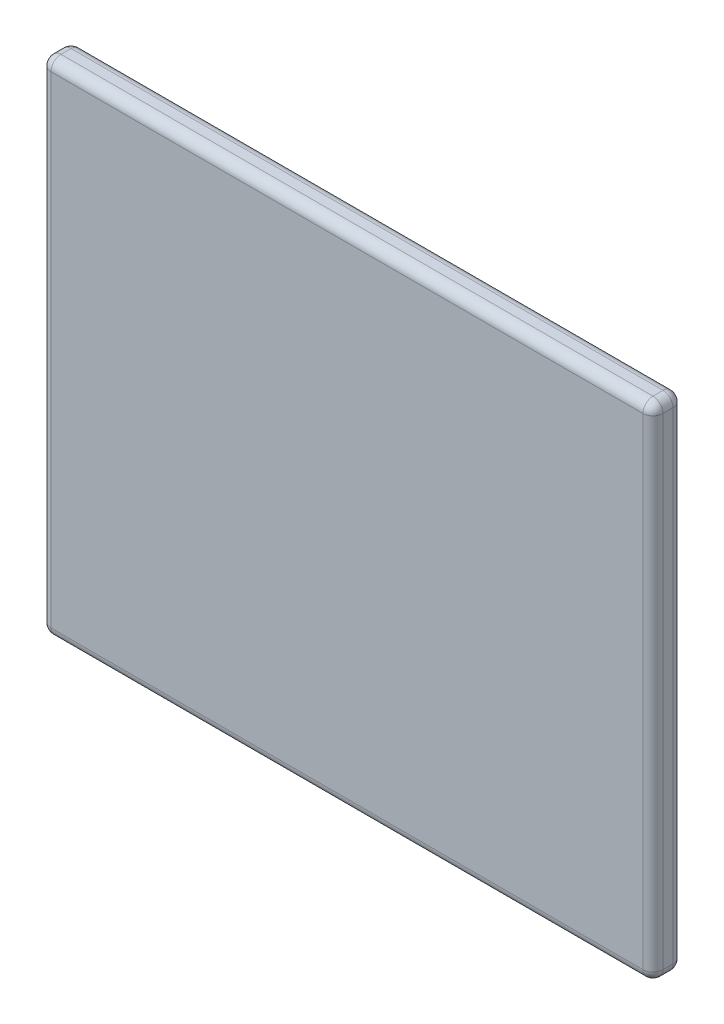
ISO-10303-21;
HEADER;
FILE_DESCRIPTION(('STEP AP214'),'2;1');
FILE_NAME('part.step','',(''),(''),'','','');
FILE_SCHEMA(('AUTOMOTIVE_DESIGN { 1 0 10303 214 1 1 1 1 }'));
ENDSEC;
DATA;
#1=APPLICATION_CONTEXT('core data for automotive mechanical design processes');
#2=APPLICATION_PROTOCOL_DEFINITION('international standard','automotive_design',2000,#1);
#3=PRODUCT_CONTEXT('',#1,'mechanical');
#4=PRODUCT('Part','Part','',(#3));
#5=PRODUCT_RELATED_PRODUCT_CATEGORY('part','',(#4));
#6=PRODUCT_DEFINITION_FORMATION('','',#4);
#7=PRODUCT_DEFINITION_CONTEXT('part definition',#1,'design');
#8=PRODUCT_DEFINITION('design','',#6,#7);
#9=PRODUCT_DEFINITION_SHAPE('','',#8);
#10=(LENGTH_UNIT() NAMED_UNIT(*) SI_UNIT(.MILLI.,.METRE.));
#11=(NAMED_UNIT(*) PLANE_ANGLE_UNIT() SI_UNIT($,.RADIAN.));
#12=(NAMED_UNIT(*) SI_UNIT($,.STERADIAN.) SOLID_ANGLE_UNIT());
#13=UNCERTAINTY_MEASURE_WITH_UNIT(LENGTH_MEASURE(1.E-05),#10,'distance_accuracy_value','');
#14=(GEOMETRIC_REPRESENTATION_CONTEXT(3) GLOBAL_UNCERTAINTY_ASSIGNED_CONTEXT((#13)) GLOBAL_UNIT_ASSIGNED_CONTEXT((#10,
#11,#12)) REPRESENTATION_CONTEXT('',''));
#15=CARTESIAN_POINT('',(0.,0.,0.));
#16=DIRECTION('',(0.,0.,1.));
#17=DIRECTION('',(1.,0.,0.));
#18=AXIS2_PLACEMENT_3D('',#15,#16,#17);
#19=CARTESIAN_POINT('',(30.5,25.,3.));
#20=DIRECTION('',(-1.,0.,0.));
#21=DIRECTION('',(0.,-1.,0.));
#22=AXIS2_PLACEMENT_3D('',#19,#20,#21);
#23=PLANE('',#22);
#24=DIRECTION('',(0.,0.,-1.));
#25=VECTOR('',#24,1.);
#26=CARTESIAN_POINT('',(30.5,24.,3.));
#27=LINE('',#26,#25);
#28=CARTESIAN_POINT('',(30.5,24.,1.));
#29=VERTEX_POINT('',#28);
#30=CARTESIAN_POINT('',(30.5,24.,2.));
#31=VERTEX_POINT('',#30);
#32=EDGE_CURVE('E202',#29,#31,#27,.F.);
#33=ORIENTED_EDGE('',*,*,#32,.T.);
#34=DIRECTION('',(0.,1.,0.));
#35=VECTOR('',#34,1.);
#36=CARTESIAN_POINT('',(30.5,-25.,2.));
#37=LINE('',#36,#35);
#38=CARTESIAN_POINT('',(30.5,-24.,2.));
#39=VERTEX_POINT('',#38);
#40=EDGE_CURVE('E205',#31,#39,#37,.F.);
#41=ORIENTED_EDGE('',*,*,#40,.T.);
#42=DIRECTION('',(0.,0.,-1.));
#43=VECTOR('',#42,1.);
#44=CARTESIAN_POINT('',(30.5,-24.,3.));
#45=LINE('',#44,#43);
#46=CARTESIAN_POINT('',(30.5,-24.,1.));
#47=VERTEX_POINT('',#46);
#48=EDGE_CURVE('E196',#39,#47,#45,.T.);
#49=ORIENTED_EDGE('',*,*,#48,.T.);
#50=DIRECTION('',(0.,1.,0.));
#51=VECTOR('',#50,1.);
#52=CARTESIAN_POINT('',(30.5,25.,1.));
#53=LINE('',#52,#51);
#54=EDGE_CURVE('E199',#47,#29,#53,.T.);
#55=ORIENTED_EDGE('',*,*,#54,.T.);
#56=EDGE_LOOP('',(#33,#41,#49,#55));
#57=FACE_BOUND('',#56,.T.);
#58=ADVANCED_FACE('F39',(#57),#23,.F.);
#59=CARTESIAN_POINT('',(-30.5,25.,3.));
#60=DIRECTION('',(0.,-1.,0.));
#61=DIRECTION('',(0.,0.,-1.));
#62=AXIS2_PLACEMENT_3D('',#59,#60,#61);
#63=PLANE('',#62);
#64=DIRECTION('',(-1.,0.,0.));
#65=VECTOR('',#64,1.);
#66=CARTESIAN_POINT('',(30.5,25.,2.));
#67=LINE('',#66,#65);
#68=CARTESIAN_POINT('',(-29.5,25.,2.));
#69=VERTEX_POINT('',#68);
#70=CARTESIAN_POINT('',(29.5,25.,2.));
#71=VERTEX_POINT('',#70);
#72=EDGE_CURVE('E136',#69,#71,#67,.F.);
#73=ORIENTED_EDGE('',*,*,#72,.T.);
#74=DIRECTION('',(0.,0.,-1.));
#75=VECTOR('',#74,1.);
#76=CARTESIAN_POINT('',(29.5,25.,3.));
#77=LINE('',#76,#75);
#78=CARTESIAN_POINT('',(29.5,25.,1.));
#79=VERTEX_POINT('',#78);
#80=EDGE_CURVE('E180',#71,#79,#77,.T.);
#81=ORIENTED_EDGE('',*,*,#80,.T.);
#82=DIRECTION('',(-1.,0.,0.));
#83=VECTOR('',#82,1.);
#84=CARTESIAN_POINT('',(-30.5,25.,1.));
#85=LINE('',#84,#83);
#86=CARTESIAN_POINT('',(-29.5,25.,1.));
#87=VERTEX_POINT('',#86);
#88=EDGE_CURVE('E171',#79,#87,#85,.T.);
#89=ORIENTED_EDGE('',*,*,#88,.T.);
#90=DIRECTION('',(0.,0.,-1.));
#91=VECTOR('',#90,1.);
#92=CARTESIAN_POINT('',(-29.5,25.,3.));
#93=LINE('',#92,#91);
#94=EDGE_CURVE('E167',#87,#69,#93,.F.);
#95=ORIENTED_EDGE('',*,*,#94,.T.);
#96=EDGE_LOOP('',(#73,#81,#89,#95));
#97=FACE_BOUND('',#96,.T.);
#98=ADVANCED_FACE('F379',(#97),#63,.F.);
#99=CARTESIAN_POINT('',(-30.5,25.,3.));
#100=DIRECTION('',(1.,0.,0.));
#101=DIRECTION('',(0.,1.,0.));
#102=AXIS2_PLACEMENT_3D('',#99,#100,#101);
#103=PLANE('',#102);
#104=DIRECTION('',(0.,-1.,0.));
#105=VECTOR('',#104,1.);
#106=CARTESIAN_POINT('',(-30.5,25.,2.));
#107=LINE('',#106,#105);
#108=CARTESIAN_POINT('',(-30.5,-24.,2.));
#109=VERTEX_POINT('',#108);
#110=CARTESIAN_POINT('',(-30.5,24.,2.));
#111=VERTEX_POINT('',#110);
#112=EDGE_CURVE('E49',#109,#111,#107,.F.);
#113=ORIENTED_EDGE('',*,*,#112,.T.);
#114=DIRECTION('',(0.,0.,-1.));
#115=VECTOR('',#114,1.);
#116=CARTESIAN_POINT('',(-30.5,24.,3.));
#117=LINE('',#116,#115);
#118=CARTESIAN_POINT('',(-30.5,24.,1.));
#119=VERTEX_POINT('',#118);
#120=EDGE_CURVE('E11',#111,#119,#117,.T.);
#121=ORIENTED_EDGE('',*,*,#120,.T.);
#122=DIRECTION('',(0.,-1.,0.));
#123=VECTOR('',#122,1.);
#124=CARTESIAN_POINT('',(-30.5,25.,1.));
#125=LINE('',#124,#123);
#126=CARTESIAN_POINT('',(-30.5,-24.,1.));
#127=VERTEX_POINT('',#126);
#128=EDGE_CURVE('E222',#119,#127,#125,.T.);
#129=ORIENTED_EDGE('',*,*,#128,.T.);
#130=DIRECTION('',(0.,0.,-1.));
#131=VECTOR('',#130,1.);
#132=CARTESIAN_POINT('',(-30.5,-24.,3.));
#133=LINE('',#132,#131);
#134=EDGE_CURVE('E60',#127,#109,#133,.F.);
#135=ORIENTED_EDGE('',*,*,#134,.T.);
#136=EDGE_LOOP('',(#113,#121,#129,#135));
#137=FACE_BOUND('',#136,.T.);
#138=ADVANCED_FACE('F384',(#137),#103,.F.);
#139=CARTESIAN_POINT('',(-30.5,-25.,3.));
#140=DIRECTION('',(0.,1.,0.));
#141=DIRECTION('',(0.,0.,1.));
#142=AXIS2_PLACEMENT_3D('',#139,#140,#141);
#143=PLANE('',#142);
#144=DIRECTION('',(0.,0.,-1.));
#145=VECTOR('',#144,1.);
#146=CARTESIAN_POINT('',(29.5,-25.,3.));
#147=LINE('',#146,#145);
#148=CARTESIAN_POINT('',(29.5,-25.,1.));
#149=VERTEX_POINT('',#148);
#150=CARTESIAN_POINT('',(29.5,-25.,2.));
#151=VERTEX_POINT('',#150);
#152=EDGE_CURVE('E215',#149,#151,#147,.F.);
#153=ORIENTED_EDGE('',*,*,#152,.T.);
#154=DIRECTION('',(1.,0.,0.));
#155=VECTOR('',#154,1.);
#156=CARTESIAN_POINT('',(-30.5,-25.,2.));
#157=LINE('',#156,#155);
#158=CARTESIAN_POINT('',(-29.5,-25.,2.));
#159=VERTEX_POINT('',#158);
#160=EDGE_CURVE('E218',#151,#159,#157,.F.);
#161=ORIENTED_EDGE('',*,*,#160,.T.);
#162=DIRECTION('',(0.,0.,-1.));
#163=VECTOR('',#162,1.);
#164=CARTESIAN_POINT('',(-29.5,-25.,3.));
#165=LINE('',#164,#163);
#166=CARTESIAN_POINT('',(-29.5,-25.,1.));
#167=VERTEX_POINT('',#166);
#168=EDGE_CURVE('E209',#159,#167,#165,.T.);
#169=ORIENTED_EDGE('',*,*,#168,.T.);
#170=DIRECTION('',(1.,0.,0.));
#171=VECTOR('',#170,1.);
#172=CARTESIAN_POINT('',(-30.5,-25.,1.));
#173=LINE('',#172,#171);
#174=EDGE_CURVE('E212',#167,#149,#173,.T.);
#175=ORIENTED_EDGE('',*,*,#174,.T.);
#176=EDGE_LOOP('',(#153,#161,#169,#175));
#177=FACE_BOUND('',#176,.T.);
#178=ADVANCED_FACE('F330',(#177),#143,.F.);
#179=CARTESIAN_POINT('',(0.,0.,3.));
#180=DIRECTION('',(0.,0.,1.));
#181=DIRECTION('',(1.,0.,0.));
#182=AXIS2_PLACEMENT_3D('',#179,#180,#181);
#183=PLANE('',#182);
#184=DIRECTION('',(0.,1.,0.));
#185=VECTOR('',#184,1.);
#186=CARTESIAN_POINT('',(29.5,25.,3.));
#187=LINE('',#186,#185);
#188=CARTESIAN_POINT('',(29.5,-24.,3.));
#189=VERTEX_POINT('',#188);
#190=CARTESIAN_POINT('',(29.5,24.,3.));
#191=VERTEX_POINT('',#190);
#192=EDGE_CURVE('E164',#189,#191,#187,.T.);
#193=ORIENTED_EDGE('',*,*,#192,.T.);
#194=DIRECTION('',(-1.,0.,0.));
#195=VECTOR('',#194,1.);
#196=CARTESIAN_POINT('',(-30.5,24.,3.));
#197=LINE('',#196,#195);
#198=CARTESIAN_POINT('',(-29.5,24.,3.));
#199=VERTEX_POINT('',#198);
#200=EDGE_CURVE('E134',#191,#199,#197,.T.);
#201=ORIENTED_EDGE('',*,*,#200,.T.);
#202=DIRECTION('',(0.,-1.,0.));
#203=VECTOR('',#202,1.);
#204=CARTESIAN_POINT('',(-29.5,-25.,3.));
#205=LINE('',#204,#203);
#206=CARTESIAN_POINT('',(-29.5,-24.,3.));
#207=VERTEX_POINT('',#206);
#208=EDGE_CURVE('E153',#199,#207,#205,.T.);
#209=ORIENTED_EDGE('',*,*,#208,.T.);
#210=DIRECTION('',(1.,0.,0.));
#211=VECTOR('',#210,1.);
#212=CARTESIAN_POINT('',(30.5,-24.,3.));
#213=LINE('',#212,#211);
#214=EDGE_CURVE('E160',#207,#189,#213,.T.);
#215=ORIENTED_EDGE('',*,*,#214,.T.);
#216=EDGE_LOOP('',(#193,#201,#209,#215));
#217=FACE_BOUND('',#216,.T.);
#218=ADVANCED_FACE('F162',(#217),#183,.T.);
#219=CARTESIAN_POINT('',(0.,0.,0.));
#220=DIRECTION('',(0.,0.,1.));
#221=DIRECTION('',(1.,0.,0.));
#222=AXIS2_PLACEMENT_3D('',#219,#220,#221);
#223=PLANE('',#222);
#224=DIRECTION('',(0.,-1.,0.));
#225=VECTOR('',#224,1.);
#226=CARTESIAN_POINT('',(-29.5,0.,0.));
#227=LINE('',#226,#225);
#228=CARTESIAN_POINT('',(-29.5,-24.,0.));
#229=VERTEX_POINT('',#228);
#230=CARTESIAN_POINT('',(-29.5,24.,0.));
#231=VERTEX_POINT('',#230);
#232=EDGE_CURVE('E183',#229,#231,#227,.F.);
#233=ORIENTED_EDGE('',*,*,#232,.T.);
#234=DIRECTION('',(-1.,0.,0.));
#235=VECTOR('',#234,1.);
#236=CARTESIAN_POINT('',(0.,24.,0.));
#237=LINE('',#236,#235);
#238=CARTESIAN_POINT('',(29.5,24.,0.));
#239=VERTEX_POINT('',#238);
#240=EDGE_CURVE('E192',#231,#239,#237,.F.);
#241=ORIENTED_EDGE('',*,*,#240,.T.);
#242=DIRECTION('',(0.,1.,0.));
#243=VECTOR('',#242,1.);
#244=CARTESIAN_POINT('',(29.5,0.,0.));
#245=LINE('',#244,#243);
#246=CARTESIAN_POINT('',(29.5,-24.,0.));
#247=VERTEX_POINT('',#246);
#248=EDGE_CURVE('E189',#239,#247,#245,.F.);
#249=ORIENTED_EDGE('',*,*,#248,.T.);
#250=DIRECTION('',(1.,0.,0.));
#251=VECTOR('',#250,1.);
#252=CARTESIAN_POINT('',(0.,-24.,0.));
#253=LINE('',#252,#251);
#254=EDGE_CURVE('E186',#247,#229,#253,.F.);
#255=ORIENTED_EDGE('',*,*,#254,.T.);
#256=EDGE_LOOP('',(#233,#241,#249,#255));
#257=FACE_BOUND('',#256,.T.);
#258=ADVANCED_FACE('F348',(#257),#223,.F.);
#259=CARTESIAN_POINT('',(-30.5,-24.,1.));
#260=DIRECTION('',(1.,0.,0.));
#261=DIRECTION('',(0.,0.,-1.));
#262=AXIS2_PLACEMENT_3D('',#259,#260,#261);
#263=CYLINDRICAL_SURFACE('',#262,1.);
#264=CARTESIAN_POINT('',(29.5,-24.,1.));
#265=DIRECTION('',(1.,0.,0.));
#266=DIRECTION('',(0.,0.,-1.));
#267=AXIS2_PLACEMENT_3D('',#264,#265,#266);
#268=CIRCLE('',#267,1.);
#269=EDGE_CURVE('E43',#149,#247,#268,.T.);
#270=ORIENTED_EDGE('',*,*,#269,.F.);
#271=ORIENTED_EDGE('',*,*,#174,.F.);
#272=CARTESIAN_POINT('',(-29.5,-24.,1.));
#273=DIRECTION('',(-1.,0.,0.));
#274=DIRECTION('',(0.,0.,1.));
#275=AXIS2_PLACEMENT_3D('',#272,#273,#274);
#276=CIRCLE('',#275,1.);
#277=EDGE_CURVE('E297',#229,#167,#276,.T.);
#278=ORIENTED_EDGE('',*,*,#277,.F.);
#279=ORIENTED_EDGE('',*,*,#254,.F.);
#280=EDGE_LOOP('',(#270,#271,#278,#279));
#281=FACE_BOUND('',#280,.T.);
#282=ADVANCED_FACE('F41',(#281),#263,.T.);
#283=CARTESIAN_POINT('',(29.5,-24.,1.));
#284=DIRECTION('',(0.,0.,1.));
#285=DIRECTION('',(1.,0.,0.));
#286=AXIS2_PLACEMENT_3D('',#283,#284,#285);
#287=SPHERICAL_SURFACE('',#286,1.);
#288=CARTESIAN_POINT('',(29.5,-24.,1.));
#289=DIRECTION('',(0.,0.,-1.));
#290=DIRECTION('',(-1.,0.,0.));
#291=AXIS2_PLACEMENT_3D('',#288,#289,#290);
#292=CIRCLE('',#291,1.);
#293=EDGE_CURVE('E290',#149,#47,#292,.F.);
#294=ORIENTED_EDGE('',*,*,#293,.F.);
#295=ORIENTED_EDGE('',*,*,#269,.T.);
#296=CARTESIAN_POINT('',(29.5,-24.,1.));
#297=DIRECTION('',(0.,-1.,0.));
#298=DIRECTION('',(0.,0.,-1.));
#299=AXIS2_PLACEMENT_3D('',#296,#297,#298);
#300=CIRCLE('',#299,1.);
#301=EDGE_CURVE('E294',#47,#247,#300,.F.);
#302=ORIENTED_EDGE('',*,*,#301,.F.);
#303=EDGE_LOOP('',(#294,#295,#302));
#304=FACE_BOUND('',#303,.T.);
#305=ADVANCED_FACE('F310',(#304),#287,.T.);
#306=CARTESIAN_POINT('',(-29.5,-24.,1.));
#307=DIRECTION('',(0.,0.,1.));
#308=DIRECTION('',(1.,0.,0.));
#309=AXIS2_PLACEMENT_3D('',#306,#307,#308);
#310=SPHERICAL_SURFACE('',#309,1.);
#311=CARTESIAN_POINT('',(-29.5,-24.,1.));
#312=DIRECTION('',(0.,-1.,0.));
#313=DIRECTION('',(0.,0.,-1.));
#314=AXIS2_PLACEMENT_3D('',#311,#312,#313);
#315=CIRCLE('',#314,1.);
#316=EDGE_CURVE('E282',#229,#127,#315,.F.);
#317=ORIENTED_EDGE('',*,*,#316,.F.);
#318=ORIENTED_EDGE('',*,*,#277,.T.);
#319=CARTESIAN_POINT('',(-29.5,-24.,1.));
#320=DIRECTION('',(0.,0.,-1.));
#321=DIRECTION('',(-1.,0.,0.));
#322=AXIS2_PLACEMENT_3D('',#319,#320,#321);
#323=CIRCLE('',#322,1.);
#324=EDGE_CURVE('E286',#127,#167,#323,.F.);
#325=ORIENTED_EDGE('',*,*,#324,.F.);
#326=EDGE_LOOP('',(#317,#318,#325));
#327=FACE_BOUND('',#326,.T.);
#328=ADVANCED_FACE('F341',(#327),#310,.T.);
#329=CARTESIAN_POINT('',(29.5,25.,1.));
#330=DIRECTION('',(0.,1.,0.));
#331=DIRECTION('',(-1.,0.,0.));
#332=AXIS2_PLACEMENT_3D('',#329,#330,#331);
#333=CYLINDRICAL_SURFACE('',#332,1.);
#334=ORIENTED_EDGE('',*,*,#301,.T.);
#335=ORIENTED_EDGE('',*,*,#248,.F.);
#336=CARTESIAN_POINT('',(29.5,24.,1.));
#337=DIRECTION('',(0.,1.,0.));
#338=DIRECTION('',(0.,0.,1.));
#339=AXIS2_PLACEMENT_3D('',#336,#337,#338);
#340=CIRCLE('',#339,1.);
#341=EDGE_CURVE('E275',#29,#239,#340,.T.);
#342=ORIENTED_EDGE('',*,*,#341,.F.);
#343=ORIENTED_EDGE('',*,*,#54,.F.);
#344=EDGE_LOOP('',(#334,#335,#342,#343));
#345=FACE_BOUND('',#344,.T.);
#346=ADVANCED_FACE('F318',(#345),#333,.T.);
#347=CARTESIAN_POINT('',(29.5,-24.,3.));
#348=DIRECTION('',(0.,0.,-1.));
#349=DIRECTION('',(-1.,0.,0.));
#350=AXIS2_PLACEMENT_3D('',#347,#348,#349);
#351=CYLINDRICAL_SURFACE('',#350,1.);
#352=ORIENTED_EDGE('',*,*,#293,.T.);
#353=ORIENTED_EDGE('',*,*,#48,.F.);
#354=CARTESIAN_POINT('',(29.5,-24.,2.));
#355=DIRECTION('',(0.,0.,1.));
#356=DIRECTION('',(1.,0.,0.));
#357=AXIS2_PLACEMENT_3D('',#354,#355,#356);
#358=CIRCLE('',#357,1.);
#359=EDGE_CURVE('E271',#151,#39,#358,.T.);
#360=ORIENTED_EDGE('',*,*,#359,.F.);
#361=ORIENTED_EDGE('',*,*,#152,.F.);
#362=EDGE_LOOP('',(#352,#353,#360,#361));
#363=FACE_BOUND('',#362,.T.);
#364=ADVANCED_FACE('F327',(#363),#351,.T.);
#365=CARTESIAN_POINT('',(0.,-24.,2.));
#366=DIRECTION('',(-1.,0.,0.));
#367=DIRECTION('',(0.,0.,1.));
#368=AXIS2_PLACEMENT_3D('',#365,#366,#367);
#369=CYLINDRICAL_SURFACE('',#368,1.);
#370=CARTESIAN_POINT('',(-29.5,-24.,2.));
#371=DIRECTION('',(-1.,0.,0.));
#372=DIRECTION('',(0.,0.,1.));
#373=AXIS2_PLACEMENT_3D('',#370,#371,#372);
#374=CIRCLE('',#373,1.);
#375=EDGE_CURVE('E263',#159,#207,#374,.T.);
#376=ORIENTED_EDGE('',*,*,#375,.F.);
#377=ORIENTED_EDGE('',*,*,#160,.F.);
#378=CARTESIAN_POINT('',(29.5,-24.,2.));
#379=DIRECTION('',(1.,0.,0.));
#380=DIRECTION('',(0.,1.,0.));
#381=AXIS2_PLACEMENT_3D('',#378,#379,#380);
#382=CIRCLE('',#381,1.);
#383=EDGE_CURVE('E267',#189,#151,#382,.T.);
#384=ORIENTED_EDGE('',*,*,#383,.F.);
#385=ORIENTED_EDGE('',*,*,#214,.F.);
#386=EDGE_LOOP('',(#376,#377,#384,#385));
#387=FACE_BOUND('',#386,.T.);
#388=ADVANCED_FACE('F334',(#387),#369,.T.);
#389=CARTESIAN_POINT('',(-29.5,-24.,3.));
#390=DIRECTION('',(0.,0.,-1.));
#391=DIRECTION('',(-1.,0.,0.));
#392=AXIS2_PLACEMENT_3D('',#389,#390,#391);
#393=CYLINDRICAL_SURFACE('',#392,1.);
#394=ORIENTED_EDGE('',*,*,#324,.T.);
#395=ORIENTED_EDGE('',*,*,#168,.F.);
#396=CARTESIAN_POINT('',(-29.5,-24.,2.));
#397=DIRECTION('',(0.,0.,1.));
#398=DIRECTION('',(1.,0.,0.));
#399=AXIS2_PLACEMENT_3D('',#396,#397,#398);
#400=CIRCLE('',#399,1.);
#401=EDGE_CURVE('E260',#109,#159,#400,.T.);
#402=ORIENTED_EDGE('',*,*,#401,.F.);
#403=ORIENTED_EDGE('',*,*,#134,.F.);
#404=EDGE_LOOP('',(#394,#395,#402,#403));
#405=FACE_BOUND('',#404,.T.);
#406=ADVANCED_FACE('F339',(#405),#393,.T.);
#407=CARTESIAN_POINT('',(-29.5,25.,1.));
#408=DIRECTION('',(0.,-1.,0.));
#409=DIRECTION('',(1.,0.,0.));
#410=AXIS2_PLACEMENT_3D('',#407,#408,#409);
#411=CYLINDRICAL_SURFACE('',#410,1.);
#412=ORIENTED_EDGE('',*,*,#316,.T.);
#413=ORIENTED_EDGE('',*,*,#128,.F.);
#414=CARTESIAN_POINT('',(-29.5,24.,1.));
#415=DIRECTION('',(0.,1.,0.));
#416=DIRECTION('',(0.,0.,1.));
#417=AXIS2_PLACEMENT_3D('',#414,#415,#416);
#418=CIRCLE('',#417,1.);
#419=EDGE_CURVE('E256',#231,#119,#418,.T.);
#420=ORIENTED_EDGE('',*,*,#419,.F.);
#421=ORIENTED_EDGE('',*,*,#232,.F.);
#422=EDGE_LOOP('',(#412,#413,#420,#421));
#423=FACE_BOUND('',#422,.T.);
#424=ADVANCED_FACE('F345',(#423),#411,.T.);
#425=CARTESIAN_POINT('',(-30.5,24.,1.));
#426=DIRECTION('',(-1.,0.,0.));
#427=DIRECTION('',(0.,0.,1.));
#428=AXIS2_PLACEMENT_3D('',#425,#426,#427);
#429=CYLINDRICAL_SURFACE('',#428,1.);
#430=CARTESIAN_POINT('',(29.5,24.,1.));
#431=DIRECTION('',(1.,0.,0.));
#432=DIRECTION('',(0.,1.,0.));
#433=AXIS2_PLACEMENT_3D('',#430,#431,#432);
#434=CIRCLE('',#433,1.);
#435=EDGE_CURVE('E278',#239,#79,#434,.T.);
#436=ORIENTED_EDGE('',*,*,#435,.F.);
#437=ORIENTED_EDGE('',*,*,#240,.F.);
#438=CARTESIAN_POINT('',(-29.5,24.,1.));
#439=DIRECTION('',(-1.,0.,0.));
#440=DIRECTION('',(0.,0.,1.));
#441=AXIS2_PLACEMENT_3D('',#438,#439,#440);
#442=CIRCLE('',#441,1.);
#443=EDGE_CURVE('E252',#87,#231,#442,.T.);
#444=ORIENTED_EDGE('',*,*,#443,.F.);
#445=ORIENTED_EDGE('',*,*,#88,.F.);
#446=EDGE_LOOP('',(#436,#437,#444,#445));
#447=FACE_BOUND('',#446,.T.);
#448=ADVANCED_FACE('F352',(#447),#429,.T.);
#449=CARTESIAN_POINT('',(29.5,24.,1.));
#450=DIRECTION('',(0.,0.,1.));
#451=DIRECTION('',(1.,0.,0.));
#452=AXIS2_PLACEMENT_3D('',#449,#450,#451);
#453=SPHERICAL_SURFACE('',#452,1.);
#454=ORIENTED_EDGE('',*,*,#341,.T.);
#455=ORIENTED_EDGE('',*,*,#435,.T.);
#456=CARTESIAN_POINT('',(29.5,24.,1.));
#457=DIRECTION('',(0.,0.,-1.));
#458=DIRECTION('',(-1.,0.,0.));
#459=AXIS2_PLACEMENT_3D('',#456,#457,#458);
#460=CIRCLE('',#459,1.);
#461=EDGE_CURVE('E248',#29,#79,#460,.F.);
#462=ORIENTED_EDGE('',*,*,#461,.F.);
#463=EDGE_LOOP('',(#454,#455,#462));
#464=FACE_BOUND('',#463,.T.);
#465=ADVANCED_FACE('F356',(#464),#453,.T.);
#466=CARTESIAN_POINT('',(29.5,-24.,2.));
#467=DIRECTION('',(0.,0.,1.));
#468=DIRECTION('',(1.,0.,0.));
#469=AXIS2_PLACEMENT_3D('',#466,#467,#468);
#470=SPHERICAL_SURFACE('',#469,1.);
#471=ORIENTED_EDGE('',*,*,#383,.T.);
#472=ORIENTED_EDGE('',*,*,#359,.T.);
#473=CARTESIAN_POINT('',(29.5,-24.,2.));
#474=DIRECTION('',(0.,-1.,0.));
#475=DIRECTION('',(0.,0.,-1.));
#476=AXIS2_PLACEMENT_3D('',#473,#474,#475);
#477=CIRCLE('',#476,1.);
#478=EDGE_CURVE('E245',#189,#39,#477,.F.);
#479=ORIENTED_EDGE('',*,*,#478,.F.);
#480=EDGE_LOOP('',(#471,#472,#479));
#481=FACE_BOUND('',#480,.T.);
#482=ADVANCED_FACE('F367',(#481),#470,.T.);
#483=CARTESIAN_POINT('',(-29.5,-24.,2.));
#484=DIRECTION('',(0.,0.,1.));
#485=DIRECTION('',(1.,0.,0.));
#486=AXIS2_PLACEMENT_3D('',#483,#484,#485);
#487=SPHERICAL_SURFACE('',#486,1.);
#488=ORIENTED_EDGE('',*,*,#401,.T.);
#489=ORIENTED_EDGE('',*,*,#375,.T.);
#490=CARTESIAN_POINT('',(-29.5,-24.,2.));
#491=DIRECTION('',(0.,-1.,0.));
#492=DIRECTION('',(0.,0.,-1.));
#493=AXIS2_PLACEMENT_3D('',#490,#491,#492);
#494=CIRCLE('',#493,1.);
#495=EDGE_CURVE('E156',#109,#207,#494,.F.);
#496=ORIENTED_EDGE('',*,*,#495,.F.);
#497=EDGE_LOOP('',(#488,#489,#496));
#498=FACE_BOUND('',#497,.T.);
#499=ADVANCED_FACE('F369',(#498),#487,.T.);
#500=CARTESIAN_POINT('',(-29.5,24.,1.));
#501=DIRECTION('',(0.,0.,1.));
#502=DIRECTION('',(1.,0.,0.));
#503=AXIS2_PLACEMENT_3D('',#500,#501,#502);
#504=SPHERICAL_SURFACE('',#503,1.);
#505=ORIENTED_EDGE('',*,*,#443,.T.);
#506=ORIENTED_EDGE('',*,*,#419,.T.);
#507=CARTESIAN_POINT('',(-29.5,24.,1.));
#508=DIRECTION('',(0.,0.,-1.));
#509=DIRECTION('',(-1.,0.,0.));
#510=AXIS2_PLACEMENT_3D('',#507,#508,#509);
#511=CIRCLE('',#510,1.);
#512=EDGE_CURVE('E240',#87,#119,#511,.F.);
#513=ORIENTED_EDGE('',*,*,#512,.F.);
#514=EDGE_LOOP('',(#505,#506,#513));
#515=FACE_BOUND('',#514,.T.);
#516=ADVANCED_FACE('F375',(#515),#504,.T.);
#517=CARTESIAN_POINT('',(29.5,24.,3.));
#518=DIRECTION('',(0.,0.,-1.));
#519=DIRECTION('',(-1.,0.,0.));
#520=AXIS2_PLACEMENT_3D('',#517,#518,#519);
#521=CYLINDRICAL_SURFACE('',#520,1.);
#522=ORIENTED_EDGE('',*,*,#461,.T.);
#523=ORIENTED_EDGE('',*,*,#80,.F.);
#524=CARTESIAN_POINT('',(29.5,24.,2.));
#525=DIRECTION('',(0.,0.,1.));
#526=DIRECTION('',(1.,0.,0.));
#527=AXIS2_PLACEMENT_3D('',#524,#525,#526);
#528=CIRCLE('',#527,1.);
#529=EDGE_CURVE('E236',#31,#71,#528,.T.);
#530=ORIENTED_EDGE('',*,*,#529,.F.);
#531=ORIENTED_EDGE('',*,*,#32,.F.);
#532=EDGE_LOOP('',(#522,#523,#530,#531));
#533=FACE_BOUND('',#532,.T.);
#534=ADVANCED_FACE('F359',(#533),#521,.T.);
#535=CARTESIAN_POINT('',(29.5,0.,2.));
#536=DIRECTION('',(0.,-1.,0.));
#537=DIRECTION('',(1.,0.,0.));
#538=AXIS2_PLACEMENT_3D('',#535,#536,#537);
#539=CYLINDRICAL_SURFACE('',#538,1.);
#540=ORIENTED_EDGE('',*,*,#478,.T.);
#541=ORIENTED_EDGE('',*,*,#40,.F.);
#542=CARTESIAN_POINT('',(29.5,24.,2.));
#543=DIRECTION('',(0.,1.,0.));
#544=DIRECTION('',(0.,0.,1.));
#545=AXIS2_PLACEMENT_3D('',#542,#543,#544);
#546=CIRCLE('',#545,1.);
#547=EDGE_CURVE('E150',#191,#31,#546,.T.);
#548=ORIENTED_EDGE('',*,*,#547,.F.);
#549=ORIENTED_EDGE('',*,*,#192,.F.);
#550=EDGE_LOOP('',(#540,#541,#548,#549));
#551=FACE_BOUND('',#550,.T.);
#552=ADVANCED_FACE('F365',(#551),#539,.T.);
#553=CARTESIAN_POINT('',(-29.5,0.,2.));
#554=DIRECTION('',(0.,1.,0.));
#555=DIRECTION('',(-1.,0.,0.));
#556=AXIS2_PLACEMENT_3D('',#553,#554,#555);
#557=CYLINDRICAL_SURFACE('',#556,1.);
#558=ORIENTED_EDGE('',*,*,#495,.T.);
#559=ORIENTED_EDGE('',*,*,#208,.F.);
#560=CARTESIAN_POINT('',(-29.5,24.,2.));
#561=DIRECTION('',(0.,1.,0.));
#562=DIRECTION('',(0.,0.,1.));
#563=AXIS2_PLACEMENT_3D('',#560,#561,#562);
#564=CIRCLE('',#563,1.);
#565=EDGE_CURVE('E143',#111,#199,#564,.T.);
#566=ORIENTED_EDGE('',*,*,#565,.F.);
#567=ORIENTED_EDGE('',*,*,#112,.F.);
#568=EDGE_LOOP('',(#558,#559,#566,#567));
#569=FACE_BOUND('',#568,.T.);
#570=ADVANCED_FACE('F154',(#569),#557,.T.);
#571=CARTESIAN_POINT('',(-29.5,24.,3.));
#572=DIRECTION('',(0.,0.,-1.));
#573=DIRECTION('',(-1.,0.,0.));
#574=AXIS2_PLACEMENT_3D('',#571,#572,#573);
#575=CYLINDRICAL_SURFACE('',#574,1.);
#576=ORIENTED_EDGE('',*,*,#512,.T.);
#577=ORIENTED_EDGE('',*,*,#120,.F.);
#578=CARTESIAN_POINT('',(-29.5,24.,2.));
#579=DIRECTION('',(0.,0.,1.));
#580=DIRECTION('',(1.,0.,0.));
#581=AXIS2_PLACEMENT_3D('',#578,#579,#580);
#582=CIRCLE('',#581,1.);
#583=EDGE_CURVE('E147',#69,#111,#582,.T.);
#584=ORIENTED_EDGE('',*,*,#583,.F.);
#585=ORIENTED_EDGE('',*,*,#94,.F.);
#586=EDGE_LOOP('',(#576,#577,#584,#585));
#587=FACE_BOUND('',#586,.T.);
#588=ADVANCED_FACE('F395',(#587),#575,.T.);
#589=CARTESIAN_POINT('',(29.5,24.,2.));
#590=DIRECTION('',(0.,0.,1.));
#591=DIRECTION('',(1.,0.,0.));
#592=AXIS2_PLACEMENT_3D('',#589,#590,#591);
#593=SPHERICAL_SURFACE('',#592,1.);
#594=ORIENTED_EDGE('',*,*,#547,.T.);
#595=ORIENTED_EDGE('',*,*,#529,.T.);
#596=CARTESIAN_POINT('',(29.5,24.,2.));
#597=DIRECTION('',(1.,0.,0.));
#598=DIRECTION('',(0.,0.,-1.));
#599=AXIS2_PLACEMENT_3D('',#596,#597,#598);
#600=CIRCLE('',#599,1.);
#601=EDGE_CURVE('E140',#191,#71,#600,.F.);
#602=ORIENTED_EDGE('',*,*,#601,.F.);
#603=EDGE_LOOP('',(#594,#595,#602));
#604=FACE_BOUND('',#603,.T.);
#605=ADVANCED_FACE('F363',(#604),#593,.T.);
#606=CARTESIAN_POINT('',(-29.5,24.,2.));
#607=DIRECTION('',(0.,0.,1.));
#608=DIRECTION('',(1.,0.,0.));
#609=AXIS2_PLACEMENT_3D('',#606,#607,#608);
#610=SPHERICAL_SURFACE('',#609,1.);
#611=ORIENTED_EDGE('',*,*,#583,.T.);
#612=ORIENTED_EDGE('',*,*,#565,.T.);
#613=CARTESIAN_POINT('',(-29.5,24.,2.));
#614=DIRECTION('',(-1.,0.,0.));
#615=DIRECTION('',(0.,0.,1.));
#616=AXIS2_PLACEMENT_3D('',#613,#614,#615);
#617=CIRCLE('',#616,1.);
#618=EDGE_CURVE('E130',#69,#199,#617,.F.);
#619=ORIENTED_EDGE('',*,*,#618,.F.);
#620=EDGE_LOOP('',(#611,#612,#619));
#621=FACE_BOUND('',#620,.T.);
#622=ADVANCED_FACE('F145',(#621),#610,.T.);
#623=CARTESIAN_POINT('',(0.,24.,2.));
#624=DIRECTION('',(1.,0.,0.));
#625=DIRECTION('',(0.,0.,-1.));
#626=AXIS2_PLACEMENT_3D('',#623,#624,#625);
#627=CYLINDRICAL_SURFACE('',#626,1.);
#628=ORIENTED_EDGE('',*,*,#601,.T.);
#629=ORIENTED_EDGE('',*,*,#72,.F.);
#630=ORIENTED_EDGE('',*,*,#618,.T.);
#631=ORIENTED_EDGE('',*,*,#200,.F.);
#632=EDGE_LOOP('',(#628,#629,#630,#631));
#633=FACE_BOUND('',#632,.T.);
#634=ADVANCED_FACE('F132',(#633),#627,.T.);
#635=CLOSED_SHELL('',(#58,#98,#138,#178,#218,#258,#282,#305,#328,#346,#364,#388,#406,#424,#448,
#465,#482,#499,#516,#534,#552,#570,#588,#605,#622,#634));
#636=MANIFOLD_SOLID_BREP('B2',#635);
#637=ADVANCED_BREP_SHAPE_REPRESENTATION('',(#18,#636),#14);
#638=SHAPE_DEFINITION_REPRESENTATION(#9,#637);
ENDSEC;
END-ISO-10303-21;
